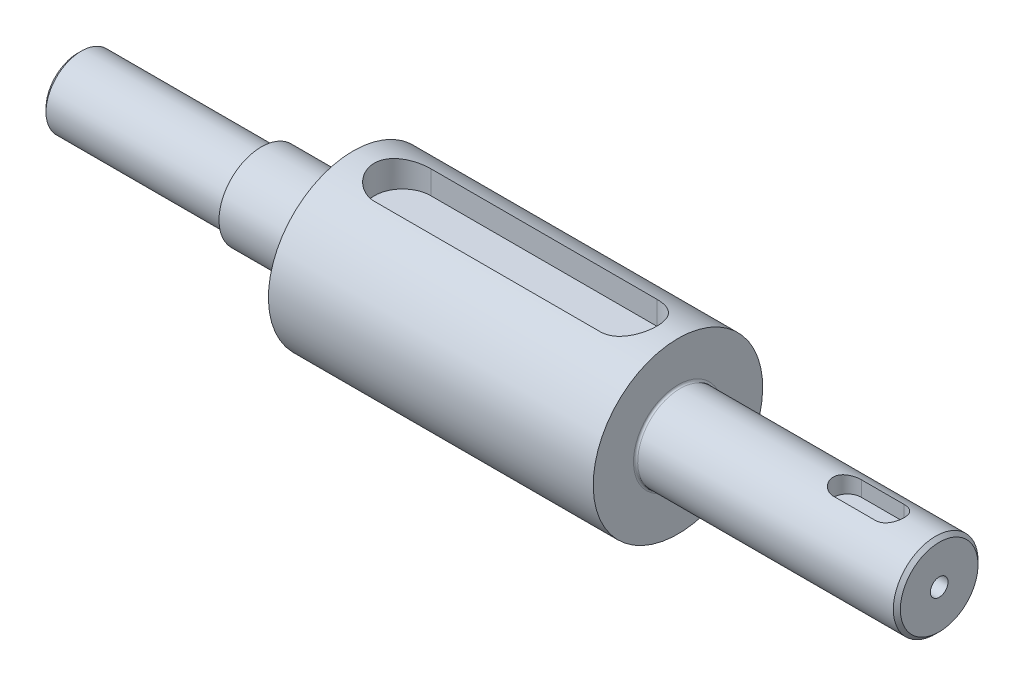
ISO-10303-21;
HEADER;
FILE_DESCRIPTION(('STEP AP214'),'2;1');
FILE_NAME('part.step','',(''),(''),'','','');
FILE_SCHEMA(('AUTOMOTIVE_DESIGN { 1 0 10303 214 1 1 1 1 }'));
ENDSEC;
DATA;
#1=APPLICATION_CONTEXT('core data for automotive mechanical design processes');
#2=APPLICATION_PROTOCOL_DEFINITION('international standard','automotive_design',2000,#1);
#3=PRODUCT_CONTEXT('',#1,'mechanical');
#4=PRODUCT('Part','Part','',(#3));
#5=PRODUCT_RELATED_PRODUCT_CATEGORY('part','',(#4));
#6=PRODUCT_DEFINITION_FORMATION('','',#4);
#7=PRODUCT_DEFINITION_CONTEXT('part definition',#1,'design');
#8=PRODUCT_DEFINITION('design','',#6,#7);
#9=PRODUCT_DEFINITION_SHAPE('','',#8);
#10=(LENGTH_UNIT() NAMED_UNIT(*) SI_UNIT(.MILLI.,.METRE.));
#11=(NAMED_UNIT(*) PLANE_ANGLE_UNIT() SI_UNIT($,.RADIAN.));
#12=(NAMED_UNIT(*) SI_UNIT($,.STERADIAN.) SOLID_ANGLE_UNIT());
#13=UNCERTAINTY_MEASURE_WITH_UNIT(LENGTH_MEASURE(1.E-05),#10,'distance_accuracy_value','');
#14=(GEOMETRIC_REPRESENTATION_CONTEXT(3) GLOBAL_UNCERTAINTY_ASSIGNED_CONTEXT((#13)) GLOBAL_UNIT_ASSIGNED_CONTEXT((#10,
#11,#12)) REPRESENTATION_CONTEXT('',''));
#15=CARTESIAN_POINT('',(0.,0.,0.));
#16=DIRECTION('',(0.,0.,1.));
#17=DIRECTION('',(1.,0.,0.));
#18=AXIS2_PLACEMENT_3D('',#15,#16,#17);
#19=CARTESIAN_POINT('',(60.,0.,0.));
#20=DIRECTION('',(1.,0.,0.));
#21=DIRECTION('',(0.,1.,0.));
#22=AXIS2_PLACEMENT_3D('',#19,#20,#21);
#23=CYLINDRICAL_SURFACE('',#22,6.00000000000001);
#24=CARTESIAN_POINT('',(23.3,0.,0.));
#25=DIRECTION('',(1.,0.,0.));
#26=DIRECTION('',(0.,1.,0.));
#27=AXIS2_PLACEMENT_3D('',#24,#25,#26);
#28=CIRCLE('',#27,6.00000000000001);
#29=CARTESIAN_POINT('',(23.3,6.,0.));
#30=VERTEX_POINT('',#29);
#31=EDGE_CURVE('E55',#30,#30,#28,.T.);
#32=ORIENTED_EDGE('',*,*,#31,.T.);
#33=EDGE_LOOP('',(#32));
#34=FACE_BOUND('',#33,.T.);
#35=CARTESIAN_POINT('',(59.5,0.,0.));
#36=DIRECTION('',(-1.,0.,0.));
#37=DIRECTION('',(0.,0.,1.));
#38=AXIS2_PLACEMENT_3D('',#35,#36,#37);
#39=CIRCLE('',#38,6.00000000000001);
#40=CARTESIAN_POINT('',(59.5,0.,6.00000000000001));
#41=VERTEX_POINT('',#40);
#42=EDGE_CURVE('E302',#41,#41,#39,.T.);
#43=ORIENTED_EDGE('',*,*,#42,.T.);
#44=EDGE_LOOP('',(#43));
#45=FACE_BOUND('',#44,.T.);
#46=CARTESIAN_POINT('',(53.,5.65685424949238,2.));
#47=CARTESIAN_POINT('',(53.0545809936022,5.65684884188678,2.0000014949184));
#48=CARTESIAN_POINT('',(53.1091341243786,5.6576451988649,1.99776424917478));
#49=CARTESIAN_POINT('',(53.2178171681098,5.66078654578442,1.9888512140728));
#50=CARTESIAN_POINT('',(53.2719471913194,5.66313111768244,1.98217662286705));
#51=CARTESIAN_POINT('',(53.4327842863903,5.67238184449302,1.95562135046157));
#52=CARTESIAN_POINT('',(53.538361692541,5.6815058499903,1.92920846605623));
#53=CARTESIAN_POINT('',(53.7432503848876,5.70456149397718,1.85991682366085));
#54=CARTESIAN_POINT('',(53.8425650937458,5.71849047905859,1.81704715197507));
#55=CARTESIAN_POINT('',(54.0326796680109,5.74957574438921,1.71614645792974));
#56=CARTESIAN_POINT('',(54.1234742581347,5.76673400456216,1.65810612564547));
#57=CARTESIAN_POINT('',(54.2974404626491,5.80308960804095,1.52610278704602));
#58=CARTESIAN_POINT('',(54.3802297609252,5.82233755536618,1.45164996064407));
#59=CARTESIAN_POINT('',(54.5324120355834,5.86027697385956,1.28997688598296));
#60=CARTESIAN_POINT('',(54.6018026265119,5.87896834543706,1.20275436910907));
#61=CARTESIAN_POINT('',(54.7269590376084,5.91427765988454,1.01520729191252));
#62=CARTESIAN_POINT('',(54.7823219688045,5.93082875123708,0.914600178716988));
#63=CARTESIAN_POINT('',(54.8751845033745,5.95939217209317,0.704858499931712));
#64=CARTESIAN_POINT('',(54.9126895636409,5.97140588786619,0.595726551186833));
#65=CARTESIAN_POINT('',(54.9674714521827,5.98918142285845,0.376058690956067));
#66=CARTESIAN_POINT('',(54.9854065451074,5.99514617977147,0.265703668920218));
#67=CARTESIAN_POINT('',(55.0026325970512,6.00087216807634,0.0433979389113407));
#68=CARTESIAN_POINT('',(55.0019279985395,6.00063487762605,-0.0685523824907898));
#69=CARTESIAN_POINT('',(54.9823114337867,5.99412077270532,-0.286207690558789));
#70=CARTESIAN_POINT('',(54.9641147240811,5.98808121982527,-0.391985405251077));
#71=CARTESIAN_POINT('',(54.9112136026517,5.97093921001647,-0.598888128753316));
#72=CARTESIAN_POINT('',(54.8765082755875,5.95983647235462,-0.700012879232932));
#73=CARTESIAN_POINT('',(54.7911572607987,5.93351336542608,-0.896305246061929));
#74=CARTESIAN_POINT('',(54.7403079097553,5.91824075676625,-0.99137701130799));
#75=CARTESIAN_POINT('',(54.6242800972186,5.88516775360088,-1.17184917819498));
#76=CARTESIAN_POINT('',(54.559097737907,5.86736667195186,-1.25724693942937));
#77=CARTESIAN_POINT('',(54.4126579000063,5.83012543885479,-1.42019467942243));
#78=CARTESIAN_POINT('',(54.3307889127806,5.81064757359828,-1.4971872232254));
#79=CARTESIAN_POINT('',(54.1551170205677,5.77294980945702,-1.63654404964077));
#80=CARTESIAN_POINT('',(54.0613102751935,5.75473031831506,-1.69890360636763));
#81=CARTESIAN_POINT('',(53.8626396432934,5.72140062752635,-1.80800665118557));
#82=CARTESIAN_POINT('',(53.7576329701341,5.70634029896469,-1.85450601901537));
#83=CARTESIAN_POINT('',(53.5407060448201,5.68162194124078,-1.92892046140223));
#84=CARTESIAN_POINT('',(53.4287970132557,5.67195538817985,-1.95686487211071));
#85=CARTESIAN_POINT('',(53.263162726504,5.6627308418944,-1.98331631256166));
#86=CARTESIAN_POINT('',(53.2107172202915,5.66053335389204,-1.98957012251023));
#87=CARTESIAN_POINT('',(53.1055238432004,5.65759407142798,-1.9979092321424));
#88=CARTESIAN_POINT('',(53.0527764509112,5.65685039859056,-1.99999991078996));
#89=CARTESIAN_POINT('',(53.,5.65685424949238,-2.));
#90=B_SPLINE_CURVE_WITH_KNOTS('',3,(#46,#47,#48,#49,#50,#51,#52,#53,#54,#55,#56,#57,#58,#59,#60,
#61,#62,#63,#64,#65,#66,#67,#68,#69,#70,#71,#72,#73,#74,#75,#76,#77,#78,#79,#80,#81,#82,#83,#84,
#85,#86,#87,#88,#89),.UNSPECIFIED.,.F.,.F.,(4,2,2,2,2,2,2,2,2,2,2,2,2,2,2,2,2,2,2,2,2,4),(0.,
0.163636969470867,0.327229772338926,0.653162396790749,0.978915321932481,1.30486862627062,
1.64233009925356,1.97985159727495,2.32618265866203,2.67240782242255,3.00658941454806,
3.34069136061285,3.66168836931471,3.98270317816496,4.30794037651936,4.63326613177538,
4.973881081161,5.31460588498485,5.6603605985608,6.00556734973679,6.16399790665502,
6.32222363058113),.UNSPECIFIED.);
#91=CARTESIAN_POINT('',(53.,5.65685424949238,2.));
#92=VERTEX_POINT('',#91);
#93=CARTESIAN_POINT('',(53.,5.65685424949238,-2.));
#94=VERTEX_POINT('',#93);
#95=EDGE_CURVE('E257',#92,#94,#90,.T.);
#96=ORIENTED_EDGE('',*,*,#95,.F.);
#97=DIRECTION('',(1.,0.,0.));
#98=VECTOR('',#97,1.);
#99=CARTESIAN_POINT('',(60.,5.65685424949238,2.));
#100=LINE('',#99,#98);
#101=CARTESIAN_POINT('',(47.,5.65685424949238,2.));
#102=VERTEX_POINT('',#101);
#103=EDGE_CURVE('E295',#102,#92,#100,.T.);
#104=ORIENTED_EDGE('',*,*,#103,.F.);
#105=CARTESIAN_POINT('',(47.,5.65685424949238,-2.));
#106=CARTESIAN_POINT('',(46.9454190063977,5.65684884188678,-2.00000149491839));
#107=CARTESIAN_POINT('',(46.8908658756213,5.6576451988649,-1.99776424917478));
#108=CARTESIAN_POINT('',(46.7821828318902,5.66078654578442,-1.9888512140728));
#109=CARTESIAN_POINT('',(46.7280528086806,5.66313111768244,-1.98217662286705));
#110=CARTESIAN_POINT('',(46.5672157136097,5.67238184449302,-1.95562135046157));
#111=CARTESIAN_POINT('',(46.461638307459,5.6815058499903,-1.92920846605622));
#112=CARTESIAN_POINT('',(46.2567496151124,5.70456149397718,-1.85991682366085));
#113=CARTESIAN_POINT('',(46.1574349062541,5.71849047905858,-1.81704715197506));
#114=CARTESIAN_POINT('',(45.9673203319891,5.74957574438921,-1.71614645792973));
#115=CARTESIAN_POINT('',(45.8765257418653,5.76673400456216,-1.65810612564547));
#116=CARTESIAN_POINT('',(45.7025595373509,5.80308960804095,-1.52610278704602));
#117=CARTESIAN_POINT('',(45.6197702390748,5.82233755536618,-1.45164996064407));
#118=CARTESIAN_POINT('',(45.4675879644166,5.86027697385956,-1.28997688598296));
#119=CARTESIAN_POINT('',(45.3981973734881,5.87896834543706,-1.20275436910907));
#120=CARTESIAN_POINT('',(45.2730409623916,5.91427765988454,-1.01520729191252));
#121=CARTESIAN_POINT('',(45.2176780311955,5.93082875123708,-0.914600178716987));
#122=CARTESIAN_POINT('',(45.1248154966255,5.95939217209317,-0.704858499931711));
#123=CARTESIAN_POINT('',(45.0873104363591,5.97140588786619,-0.595726551186832));
#124=CARTESIAN_POINT('',(45.0325285478172,5.98918142285845,-0.376058690956066));
#125=CARTESIAN_POINT('',(45.0145934548926,5.99514617977147,-0.265703668920217));
#126=CARTESIAN_POINT('',(44.9973674029488,6.00087216807634,-0.0433979389113397));
#127=CARTESIAN_POINT('',(44.9980720014605,6.00063487762605,0.0685523824907907));
#128=CARTESIAN_POINT('',(45.0176885662133,5.99412077270532,0.28620769055879));
#129=CARTESIAN_POINT('',(45.0358852759189,5.98808121982527,0.391985405251078));
#130=CARTESIAN_POINT('',(45.0887863973482,5.97093921001647,0.598888128753317));
#131=CARTESIAN_POINT('',(45.1234917244125,5.95983647235462,0.700012879232933));
#132=CARTESIAN_POINT('',(45.2088427392012,5.93351336542608,0.89630524606193));
#133=CARTESIAN_POINT('',(45.2596920902447,5.91824075676625,0.99137701130799));
#134=CARTESIAN_POINT('',(45.3757199027814,5.88516775360088,1.17184917819498));
#135=CARTESIAN_POINT('',(45.440902262093,5.86736667195186,1.25724693942937));
#136=CARTESIAN_POINT('',(45.5873420999937,5.83012543885479,1.42019467942243));
#137=CARTESIAN_POINT('',(45.6692110872194,5.81064757359828,1.4971872232254));
#138=CARTESIAN_POINT('',(45.8448829794323,5.77294980945702,1.63654404964077));
#139=CARTESIAN_POINT('',(45.9386897248065,5.75473031831506,1.69890360636763));
#140=CARTESIAN_POINT('',(46.1373603567066,5.72140062752635,1.80800665118557));
#141=CARTESIAN_POINT('',(46.2423670298659,5.70634029896469,1.85450601901537));
#142=CARTESIAN_POINT('',(46.4592939551799,5.68162194124078,1.92892046140224));
#143=CARTESIAN_POINT('',(46.5712029867443,5.67195538817985,1.95686487211072));
#144=CARTESIAN_POINT('',(46.736837273496,5.6627308418944,1.98331631256166));
#145=CARTESIAN_POINT('',(46.7892827797084,5.66053335389204,1.98957012251023));
#146=CARTESIAN_POINT('',(46.8944761567996,5.65759407142798,1.9979092321424));
#147=CARTESIAN_POINT('',(46.9472235490888,5.65685039859056,1.99999991078996));
#148=CARTESIAN_POINT('',(47.,5.65685424949238,2.));
#149=B_SPLINE_CURVE_WITH_KNOTS('',3,(#105,#106,#107,#108,#109,#110,#111,#112,#113,#114,#115,
#116,#117,#118,#119,#120,#121,#122,#123,#124,#125,#126,#127,#128,#129,#130,#131,#132,#133,#134,
#135,#136,#137,#138,#139,#140,#141,#142,#143,#144,#145,#146,#147,#148),.UNSPECIFIED.,.F.,.F.,(4,
2,2,2,2,2,2,2,2,2,2,2,2,2,2,2,2,2,2,2,2,4),(0.,0.163636969470867,0.327229772338926,
0.653162396790749,0.978915321932481,1.30486862627063,1.64233009925356,1.97985159727495,
2.32618265866203,2.67240782242255,3.00658941454806,3.34069136061285,3.66168836931471,
3.98270317816496,4.30794037651936,4.63326613177538,4.97388108116101,5.31460588498485,
5.66036059856081,6.00556734973679,6.16399790665502,6.32222363058113),.UNSPECIFIED.);
#150=CARTESIAN_POINT('',(47.,5.65685424949238,-2.));
#151=VERTEX_POINT('',#150);
#152=EDGE_CURVE('E288',#151,#102,#149,.T.);
#153=ORIENTED_EDGE('',*,*,#152,.F.);
#154=DIRECTION('',(1.,0.,0.));
#155=VECTOR('',#154,1.);
#156=CARTESIAN_POINT('',(60.,5.65685424949238,-2.));
#157=LINE('',#156,#155);
#158=EDGE_CURVE('E266',#94,#151,#157,.F.);
#159=ORIENTED_EDGE('',*,*,#158,.F.);
#160=EDGE_LOOP('',(#96,#104,#153,#159));
#161=FACE_BOUND('',#160,.T.);
#162=ADVANCED_FACE('F46',(#34,#45,#161),#23,.T.);
#163=CARTESIAN_POINT('',(60.,0.,0.));
#164=DIRECTION('',(1.,0.,0.));
#165=DIRECTION('',(0.,1.,0.));
#166=AXIS2_PLACEMENT_3D('',#163,#164,#165);
#167=CYLINDRICAL_SURFACE('',#166,12.);
#168=CARTESIAN_POINT('',(-23.,0.,0.));
#169=DIRECTION('',(1.,0.,0.));
#170=DIRECTION('',(0.,1.,0.));
#171=AXIS2_PLACEMENT_3D('',#168,#169,#170);
#172=CIRCLE('',#171,12.);
#173=CARTESIAN_POINT('',(-23.,12.,0.));
#174=VERTEX_POINT('',#173);
#175=EDGE_CURVE('E205',#174,#174,#172,.T.);
#176=ORIENTED_EDGE('',*,*,#175,.T.);
#177=EDGE_LOOP('',(#176));
#178=FACE_BOUND('',#177,.T.);
#179=CARTESIAN_POINT('',(23.,0.,0.));
#180=DIRECTION('',(1.,0.,0.));
#181=DIRECTION('',(0.,1.,0.));
#182=AXIS2_PLACEMENT_3D('',#179,#180,#181);
#183=CIRCLE('',#182,12.);
#184=CARTESIAN_POINT('',(23.,12.,0.));
#185=VERTEX_POINT('',#184);
#186=EDGE_CURVE('E209',#185,#185,#183,.T.);
#187=ORIENTED_EDGE('',*,*,#186,.F.);
#188=EDGE_LOOP('',(#187));
#189=FACE_BOUND('',#188,.T.);
#190=DIRECTION('',(1.,0.,0.));
#191=VECTOR('',#190,1.);
#192=CARTESIAN_POINT('',(60.,11.3137084989848,-4.00000000000002));
#193=LINE('',#192,#191);
#194=CARTESIAN_POINT('',(-16.,11.3137084989848,-4.));
#195=VERTEX_POINT('',#194);
#196=CARTESIAN_POINT('',(16.,11.3137084989848,-4.00000000000002));
#197=VERTEX_POINT('',#196);
#198=EDGE_CURVE('E253',#195,#197,#193,.T.);
#199=ORIENTED_EDGE('',*,*,#198,.T.);
#200=CARTESIAN_POINT('',(16.,11.3137084989848,-4.00000000000001));
#201=CARTESIAN_POINT('',(16.1091313245125,11.3136910923705,-4.00001438576651));
#202=CARTESIAN_POINT('',(16.2182529194806,11.3152871024731,-3.99553419554537));
#203=CARTESIAN_POINT('',(16.4356496613588,11.3215763859361,-3.97769673248753));
#204=CARTESIAN_POINT('',(16.5439250287809,11.3262688232103,-3.96434185595522));
#205=CARTESIAN_POINT('',(16.7585447813673,11.3386032840401,-3.92891935076474));
#206=CARTESIAN_POINT('',(16.8648939240815,11.3462365576019,-3.90687756421022));
#207=CARTESIAN_POINT('',(17.0752132297324,11.364201918496,-3.85430689648188));
#208=CARTESIAN_POINT('',(17.1791833065435,11.3745341033652,-3.82377770857635));
#209=CARTESIAN_POINT('',(17.4863385275441,11.4091190527027,-3.71986482089948));
#210=CARTESIAN_POINT('',(17.685086651956,11.4369799021453,-3.63410266896588));
#211=CARTESIAN_POINT('',(18.0654028983374,11.4991525453998,-3.43228454569821));
#212=CARTESIAN_POINT('',(18.246960377233,11.5334682968154,-3.31620997228937));
#213=CARTESIAN_POINT('',(18.5948686455691,11.6061789182336,-3.05220793355649));
#214=CARTESIAN_POINT('',(18.7604562284894,11.6446750308563,-2.90330055412141));
#215=CARTESIAN_POINT('',(19.0648273651136,11.7205540276094,-2.57995313902011));
#216=CARTESIAN_POINT('',(19.203606145885,11.7579367125094,-2.40550856651357));
#217=CARTESIAN_POINT('',(19.4539171590512,11.8285552975691,-2.03041476001126));
#218=CARTESIAN_POINT('',(19.5646436932612,11.8616574966305,-1.82920040495824));
#219=CARTESIAN_POINT('',(19.7503692510222,11.9187843500282,-1.40971695235373));
#220=CARTESIAN_POINT('',(19.8253791886194,11.9428117769099,-1.19145308844236));
#221=CARTESIAN_POINT('',(19.9349428451614,11.9783628445804,-0.752117395358874));
#222=CARTESIAN_POINT('',(19.9708130850918,11.9902923605184,-0.531407346429916));
#223=CARTESIAN_POINT('',(20.0052651992241,12.0017443351774,-0.0867958692352884));
#224=CARTESIAN_POINT('',(20.0038559583873,12.0012697502156,0.137104785886808));
#225=CARTESIAN_POINT('',(19.9646229047474,11.9882415502496,0.57241536103231));
#226=CARTESIAN_POINT('',(19.9282295986696,11.9761624577266,0.78397073966375));
#227=CARTESIAN_POINT('',(19.8224270547877,11.9418784019559,1.19777632834893));
#228=CARTESIAN_POINT('',(19.7530159862731,11.9196728772387,1.40002602175549));
#229=CARTESIAN_POINT('',(19.5823150939296,11.8670267992102,1.79261022537108));
#230=CARTESIAN_POINT('',(19.4806179693939,11.8364817702071,1.98275302130577));
#231=CARTESIAN_POINT('',(19.2485580439686,11.7703352504572,2.34369935797278));
#232=CARTESIAN_POINT('',(19.1181874454123,11.7347323851811,2.51449761883744));
#233=CARTESIAN_POINT('',(18.8253242078156,11.6602518814889,2.84038544309997));
#234=CARTESIAN_POINT('',(18.6616098897011,11.6212989752184,2.99435951335509));
#235=CARTESIAN_POINT('',(18.3102019666542,11.5458957896576,3.27310303719343));
#236=CARTESIAN_POINT('',(18.1225006450003,11.5094463215614,3.39786305574725));
#237=CARTESIAN_POINT('',(17.8252870496228,11.4595759659792,3.56109757745215));
#238=CARTESIAN_POINT('',(17.7227445952325,11.4436484943195,3.61182358389814));
#239=CARTESIAN_POINT('',(17.5134350190437,11.4140167075143,3.70440095621127));
#240=CARTESIAN_POINT('',(17.4066696779244,11.4003114674865,3.74625601636388));
#241=CARTESIAN_POINT('',(17.1897829134335,11.3755873303494,3.82067426911564));
#242=CARTESIAN_POINT('',(17.0796652868959,11.3645655126344,3.85324757051516));
#243=CARTESIAN_POINT('',(16.8568318455526,11.3455648512893,3.90883841588791));
#244=CARTESIAN_POINT('',(16.7441172420382,11.3375846182867,3.93186032329111));
#245=CARTESIAN_POINT('',(16.5263575534492,11.3254693235584,3.96661962949783));
#246=CARTESIAN_POINT('',(16.4214504804214,11.3210705251979,3.97913375141091));
#247=CARTESIAN_POINT('',(16.2110316673002,11.3151843303776,3.99582494949882));
#248=CARTESIAN_POINT('',(16.1055208843321,11.3136931771535,4.00001278362333));
#249=CARTESIAN_POINT('',(16.,11.3137084989848,3.99999999999999));
#250=B_SPLINE_CURVE_WITH_KNOTS('',3,(#200,#201,#202,#203,#204,#205,#206,#207,#208,#209,#210,
#211,#212,#213,#214,#215,#216,#217,#218,#219,#220,#221,#222,#223,#224,#225,#226,#227,#228,#229,
#230,#231,#232,#233,#234,#235,#236,#237,#238,#239,#240,#241,#242,#243,#244,#245,#246,#247,#248,
#249),.UNSPECIFIED.,.F.,.F.,(4,2,2,2,2,2,2,2,2,2,2,2,2,2,2,2,2,2,2,2,2,2,2,2,4),(0.,
0.327273938941731,0.654459544677845,0.980679087086514,1.30691042048862,1.95841627077208,
2.61032287944837,3.28524582541423,3.96028882145702,4.65295094423118,5.34540127175222,
6.01376445600324,6.68196834813282,7.32396236553653,7.96599198323704,8.61646637994584,
9.26711789045787,9.94834778922914,10.6297973968768,10.9759539762202,11.3219661149517,
11.6675999574416,12.0130757272824,12.3299368411189,12.6463882889711),.UNSPECIFIED.);
#251=CARTESIAN_POINT('',(16.,11.3137084989848,3.99999999999999));
#252=VERTEX_POINT('',#251);
#253=EDGE_CURVE('E70',#197,#252,#250,.T.);
#254=ORIENTED_EDGE('',*,*,#253,.T.);
#255=DIRECTION('',(1.,0.,0.));
#256=VECTOR('',#255,1.);
#257=CARTESIAN_POINT('',(60.,11.3137084989848,3.99999999999999));
#258=LINE('',#257,#256);
#259=CARTESIAN_POINT('',(-16.,11.3137084989848,4.));
#260=VERTEX_POINT('',#259);
#261=EDGE_CURVE('E221',#252,#260,#258,.F.);
#262=ORIENTED_EDGE('',*,*,#261,.T.);
#263=CARTESIAN_POINT('',(-16.,11.3137084989848,4.));
#264=CARTESIAN_POINT('',(-16.1091313245125,11.3136910923705,4.0000143857665));
#265=CARTESIAN_POINT('',(-16.2182529194806,11.3152871024731,3.99553419554536));
#266=CARTESIAN_POINT('',(-16.4356496613588,11.3215763859361,3.97769673248752));
#267=CARTESIAN_POINT('',(-16.5439250287809,11.3262688232103,3.96434185595522));
#268=CARTESIAN_POINT('',(-16.7585447813673,11.3386032840401,3.92891935076474));
#269=CARTESIAN_POINT('',(-16.8648939240815,11.3462365576019,3.90687756421021));
#270=CARTESIAN_POINT('',(-17.0752132297324,11.364201918496,3.85430689648188));
#271=CARTESIAN_POINT('',(-17.1791833065435,11.3745341033652,3.82377770857634));
#272=CARTESIAN_POINT('',(-17.4863385275441,11.4091190527027,3.71986482089947));
#273=CARTESIAN_POINT('',(-17.685086651956,11.4369799021453,3.63410266896587));
#274=CARTESIAN_POINT('',(-18.0654028983374,11.4991525453998,3.4322845456982));
#275=CARTESIAN_POINT('',(-18.246960377233,11.5334682968154,3.31620997228937));
#276=CARTESIAN_POINT('',(-18.5948686455691,11.6061789182336,3.05220793355649));
#277=CARTESIAN_POINT('',(-18.7604562284894,11.6446750308563,2.90330055412141));
#278=CARTESIAN_POINT('',(-19.0648273651136,11.7205540276094,2.57995313902011));
#279=CARTESIAN_POINT('',(-19.203606145885,11.7579367125094,2.40550856651356));
#280=CARTESIAN_POINT('',(-19.4539171590512,11.8285552975691,2.03041476001125));
#281=CARTESIAN_POINT('',(-19.5646436932612,11.8616574966305,1.82920040495823));
#282=CARTESIAN_POINT('',(-19.7503692510222,11.9187843500282,1.40971695235373));
#283=CARTESIAN_POINT('',(-19.8253791886194,11.9428117769099,1.19145308844236));
#284=CARTESIAN_POINT('',(-19.9349428451614,11.9783628445804,0.752117395358868));
#285=CARTESIAN_POINT('',(-19.9708130850918,11.9902923605184,0.53140734642991));
#286=CARTESIAN_POINT('',(-20.0052651992241,12.0017443351774,0.0867958692352824));
#287=CARTESIAN_POINT('',(-20.0038559583873,12.0012697502156,-0.137104785886814));
#288=CARTESIAN_POINT('',(-19.9646229047474,11.9882415502496,-0.572415361032317));
#289=CARTESIAN_POINT('',(-19.9282295986696,11.9761624577266,-0.783970739663756));
#290=CARTESIAN_POINT('',(-19.8224270547877,11.9418784019559,-1.19777632834894));
#291=CARTESIAN_POINT('',(-19.7530159862731,11.9196728772387,-1.4000260217555));
#292=CARTESIAN_POINT('',(-19.5823150939296,11.8670267992102,-1.79261022537109));
#293=CARTESIAN_POINT('',(-19.4806179693939,11.8364817702071,-1.98275302130578));
#294=CARTESIAN_POINT('',(-19.2485580439686,11.7703352504572,-2.34369935797278));
#295=CARTESIAN_POINT('',(-19.1181874454123,11.7347323851811,-2.51449761883744));
#296=CARTESIAN_POINT('',(-18.8253242078155,11.6602518814889,-2.84038544309998));
#297=CARTESIAN_POINT('',(-18.6616098897011,11.6212989752184,-2.99435951335509));
#298=CARTESIAN_POINT('',(-18.3102019666542,11.5458957896576,-3.27310303719343));
#299=CARTESIAN_POINT('',(-18.1225006450003,11.5094463215614,-3.39786305574725));
#300=CARTESIAN_POINT('',(-17.8252870496228,11.4595759659792,-3.56109757745215));
#301=CARTESIAN_POINT('',(-17.7227445952325,11.4436484943195,-3.61182358389815));
#302=CARTESIAN_POINT('',(-17.5134350190437,11.4140167075143,-3.70440095621127));
#303=CARTESIAN_POINT('',(-17.4066696779244,11.4003114674865,-3.74625601636388));
#304=CARTESIAN_POINT('',(-17.1897829134335,11.3755873303494,-3.82067426911565));
#305=CARTESIAN_POINT('',(-17.0796652868959,11.3645655126344,-3.85324757051516));
#306=CARTESIAN_POINT('',(-16.8568318455526,11.3455648512893,-3.90883841588792));
#307=CARTESIAN_POINT('',(-16.7441172420382,11.3375846182867,-3.93186032329112));
#308=CARTESIAN_POINT('',(-16.5263575534492,11.3254693235584,-3.96661962949784));
#309=CARTESIAN_POINT('',(-16.4214504804214,11.3210705251979,-3.97913375141091));
#310=CARTESIAN_POINT('',(-16.2110316673002,11.3151843303776,-3.99582494949883));
#311=CARTESIAN_POINT('',(-16.1055208843321,11.3136931771535,-4.00001278362333));
#312=CARTESIAN_POINT('',(-16.,11.3137084989848,-4.));
#313=B_SPLINE_CURVE_WITH_KNOTS('',3,(#263,#264,#265,#266,#267,#268,#269,#270,#271,#272,#273,
#274,#275,#276,#277,#278,#279,#280,#281,#282,#283,#284,#285,#286,#287,#288,#289,#290,#291,#292,
#293,#294,#295,#296,#297,#298,#299,#300,#301,#302,#303,#304,#305,#306,#307,#308,#309,#310,#311,
#312),.UNSPECIFIED.,.F.,.F.,(4,2,2,2,2,2,2,2,2,2,2,2,2,2,2,2,2,2,2,2,2,2,2,2,4),(0.,
0.327273938941731,0.654459544677845,0.980679087086521,1.30691042048862,1.95841627077208,
2.61032287944837,3.28524582541423,3.96028882145702,4.65295094423118,5.34540127175222,
6.01376445600324,6.68196834813282,7.32396236553653,7.96599198323704,8.61646637994583,
9.26711789045787,9.94834778922914,10.6297973968768,10.9759539762202,11.3219661149517,
11.6675999574416,12.0130757272824,12.3299368411189,12.6463882889711),.UNSPECIFIED.);
#314=EDGE_CURVE('E245',#260,#195,#313,.T.);
#315=ORIENTED_EDGE('',*,*,#314,.T.);
#316=EDGE_LOOP('',(#199,#254,#262,#315));
#317=FACE_BOUND('',#316,.T.);
#318=ADVANCED_FACE('F223',(#178,#189,#317),#167,.T.);
#319=CARTESIAN_POINT('',(23.,12.,0.));
#320=DIRECTION('',(1.,0.,0.));
#321=DIRECTION('',(0.,1.,0.));
#322=AXIS2_PLACEMENT_3D('',#319,#320,#321);
#323=PLANE('',#322);
#324=CARTESIAN_POINT('',(23.,0.,0.));
#325=DIRECTION('',(1.,0.,0.));
#326=DIRECTION('',(0.,1.,0.));
#327=AXIS2_PLACEMENT_3D('',#324,#325,#326);
#328=CIRCLE('',#327,6.30000000000001);
#329=CARTESIAN_POINT('',(23.,6.3,0.));
#330=VERTEX_POINT('',#329);
#331=EDGE_CURVE('E11',#330,#330,#328,.F.);
#332=ORIENTED_EDGE('',*,*,#331,.T.);
#333=EDGE_LOOP('',(#332));
#334=FACE_BOUND('',#333,.T.);
#335=ORIENTED_EDGE('',*,*,#186,.T.);
#336=EDGE_LOOP('',(#335));
#337=FACE_BOUND('',#336,.T.);
#338=ADVANCED_FACE('F350',(#334,#337),#323,.T.);
#339=CARTESIAN_POINT('',(-23.,6.,0.));
#340=DIRECTION('',(-1.,0.,0.));
#341=DIRECTION('',(0.,-1.,0.));
#342=AXIS2_PLACEMENT_3D('',#339,#340,#341);
#343=PLANE('',#342);
#344=CARTESIAN_POINT('',(-23.,0.,0.));
#345=DIRECTION('',(-1.,0.,0.));
#346=DIRECTION('',(0.,-1.,0.));
#347=AXIS2_PLACEMENT_3D('',#344,#345,#346);
#348=CIRCLE('',#347,6.30000000000001);
#349=CARTESIAN_POINT('',(-23.,-6.30000000000002,0.));
#350=VERTEX_POINT('',#349);
#351=EDGE_CURVE('E322',#350,#350,#348,.F.);
#352=ORIENTED_EDGE('',*,*,#351,.T.);
#353=EDGE_LOOP('',(#352));
#354=FACE_BOUND('',#353,.T.);
#355=ORIENTED_EDGE('',*,*,#175,.F.);
#356=EDGE_LOOP('',(#355));
#357=FACE_BOUND('',#356,.T.);
#358=ADVANCED_FACE('F355',(#354,#357),#343,.T.);
#359=CARTESIAN_POINT('',(60.,0.,0.));
#360=DIRECTION('',(1.,0.,0.));
#361=DIRECTION('',(0.,1.,0.));
#362=AXIS2_PLACEMENT_3D('',#359,#360,#361);
#363=CYLINDRICAL_SURFACE('',#362,6.00000000000001);
#364=CARTESIAN_POINT('',(-23.3,0.,0.));
#365=DIRECTION('',(-1.,0.,0.));
#366=DIRECTION('',(0.,-1.,0.));
#367=AXIS2_PLACEMENT_3D('',#364,#365,#366);
#368=CIRCLE('',#367,6.00000000000001);
#369=CARTESIAN_POINT('',(-23.3,-6.00000000000002,0.));
#370=VERTEX_POINT('',#369);
#371=EDGE_CURVE('E326',#370,#370,#368,.T.);
#372=ORIENTED_EDGE('',*,*,#371,.T.);
#373=EDGE_LOOP('',(#372));
#374=FACE_BOUND('',#373,.T.);
#375=CARTESIAN_POINT('',(-35.9999999999976,0.,0.));
#376=DIRECTION('',(1.,0.,0.));
#377=DIRECTION('',(0.,1.,0.));
#378=AXIS2_PLACEMENT_3D('',#375,#376,#377);
#379=CIRCLE('',#378,6.00000000000001);
#380=CARTESIAN_POINT('',(-35.9999999999976,6.,0.));
#381=VERTEX_POINT('',#380);
#382=EDGE_CURVE('E201',#381,#381,#379,.T.);
#383=ORIENTED_EDGE('',*,*,#382,.T.);
#384=EDGE_LOOP('',(#383));
#385=FACE_BOUND('',#384,.T.);
#386=ADVANCED_FACE('F438',(#374,#385),#363,.T.);
#387=CARTESIAN_POINT('',(-35.9999999999976,4.99999999999999,0.));
#388=DIRECTION('',(-1.,0.,0.));
#389=DIRECTION('',(0.,-1.,0.));
#390=AXIS2_PLACEMENT_3D('',#387,#388,#389);
#391=PLANE('',#390);
#392=CARTESIAN_POINT('',(-35.9999999999976,0.,0.));
#393=DIRECTION('',(-1.,0.,0.));
#394=DIRECTION('',(0.,-1.,0.));
#395=AXIS2_PLACEMENT_3D('',#392,#393,#394);
#396=CIRCLE('',#395,5.3);
#397=CARTESIAN_POINT('',(-35.9999999999976,-5.30000000000001,0.));
#398=VERTEX_POINT('',#397);
#399=EDGE_CURVE('E314',#398,#398,#396,.F.);
#400=ORIENTED_EDGE('',*,*,#399,.T.);
#401=EDGE_LOOP('',(#400));
#402=FACE_BOUND('',#401,.T.);
#403=ORIENTED_EDGE('',*,*,#382,.F.);
#404=EDGE_LOOP('',(#403));
#405=FACE_BOUND('',#404,.T.);
#406=ADVANCED_FACE('F411',(#402,#405),#391,.T.);
#407=CARTESIAN_POINT('',(60.,0.,0.));
#408=DIRECTION('',(1.,0.,0.));
#409=DIRECTION('',(0.,1.,0.));
#410=AXIS2_PLACEMENT_3D('',#407,#408,#409);
#411=CYLINDRICAL_SURFACE('',#410,5.);
#412=CARTESIAN_POINT('',(-36.2999999999976,0.,0.));
#413=DIRECTION('',(-1.,0.,0.));
#414=DIRECTION('',(0.,-1.,0.));
#415=AXIS2_PLACEMENT_3D('',#412,#413,#414);
#416=CIRCLE('',#415,5.);
#417=CARTESIAN_POINT('',(-36.2999999999976,-5.00000000000001,0.));
#418=VERTEX_POINT('',#417);
#419=EDGE_CURVE('E318',#418,#418,#416,.T.);
#420=ORIENTED_EDGE('',*,*,#419,.T.);
#421=EDGE_LOOP('',(#420));
#422=FACE_BOUND('',#421,.T.);
#423=CARTESIAN_POINT('',(-61.5,0.,0.));
#424=DIRECTION('',(-1.,0.,0.));
#425=DIRECTION('',(0.,0.,1.));
#426=AXIS2_PLACEMENT_3D('',#423,#424,#425);
#427=CIRCLE('',#426,5.);
#428=CARTESIAN_POINT('',(-61.5,0.,5.));
#429=VERTEX_POINT('',#428);
#430=EDGE_CURVE('E306',#429,#429,#427,.F.);
#431=ORIENTED_EDGE('',*,*,#430,.T.);
#432=EDGE_LOOP('',(#431));
#433=FACE_BOUND('',#432,.T.);
#434=ADVANCED_FACE('F404',(#422,#433),#411,.T.);
#435=CARTESIAN_POINT('',(-62.,4.99999999999999,0.));
#436=DIRECTION('',(-1.,0.,0.));
#437=DIRECTION('',(0.,-1.,0.));
#438=AXIS2_PLACEMENT_3D('',#435,#436,#437);
#439=PLANE('',#438);
#440=CARTESIAN_POINT('',(-62.,0.,0.));
#441=DIRECTION('',(-1.,0.,0.));
#442=DIRECTION('',(0.,-1.,0.));
#443=AXIS2_PLACEMENT_3D('',#440,#441,#442);
#444=CIRCLE('',#443,4.5);
#445=CARTESIAN_POINT('',(-62.,-4.50000000000002,0.));
#446=VERTEX_POINT('',#445);
#447=EDGE_CURVE('E310',#446,#446,#444,.T.);
#448=ORIENTED_EDGE('',*,*,#447,.T.);
#449=EDGE_LOOP('',(#448));
#450=FACE_BOUND('',#449,.T.);
#451=CARTESIAN_POINT('',(-62.,0.,0.));
#452=DIRECTION('',(-1.,0.,0.));
#453=DIRECTION('',(0.,0.,1.));
#454=AXIS2_PLACEMENT_3D('',#451,#452,#453);
#455=CIRCLE('',#454,1.25);
#456=CARTESIAN_POINT('',(-62.,0.,1.25));
#457=VERTEX_POINT('',#456);
#458=EDGE_CURVE('E130',#457,#457,#455,.T.);
#459=ORIENTED_EDGE('',*,*,#458,.F.);
#460=EDGE_LOOP('',(#459));
#461=FACE_BOUND('',#460,.T.);
#462=ADVANCED_FACE('F242',(#450,#461),#439,.T.);
#463=CARTESIAN_POINT('',(-16.,12.,0.));
#464=DIRECTION('',(0.,-1.,0.));
#465=DIRECTION('',(0.,0.,-1.));
#466=AXIS2_PLACEMENT_3D('',#463,#464,#465);
#467=CYLINDRICAL_SURFACE('',#466,4.);
#468=DIRECTION('',(0.,-1.,0.));
#469=VECTOR('',#468,1.);
#470=CARTESIAN_POINT('',(-16.,12.,4.));
#471=LINE('',#470,#469);
#472=CARTESIAN_POINT('',(-16.,8.,4.));
#473=VERTEX_POINT('',#472);
#474=EDGE_CURVE('E198',#260,#473,#471,.T.);
#475=ORIENTED_EDGE('',*,*,#474,.T.);
#476=CARTESIAN_POINT('',(-16.,8.,0.));
#477=DIRECTION('',(0.,1.,0.));
#478=DIRECTION('',(0.,0.,1.));
#479=AXIS2_PLACEMENT_3D('',#476,#477,#478);
#480=CIRCLE('',#479,4.);
#481=CARTESIAN_POINT('',(-16.,8.,-4.));
#482=VERTEX_POINT('',#481);
#483=EDGE_CURVE('E163',#482,#473,#480,.T.);
#484=ORIENTED_EDGE('',*,*,#483,.F.);
#485=DIRECTION('',(0.,-1.,0.));
#486=VECTOR('',#485,1.);
#487=CARTESIAN_POINT('',(-16.,12.,-4.));
#488=LINE('',#487,#486);
#489=EDGE_CURVE('E189',#195,#482,#488,.T.);
#490=ORIENTED_EDGE('',*,*,#489,.F.);
#491=ORIENTED_EDGE('',*,*,#314,.F.);
#492=EDGE_LOOP('',(#475,#484,#490,#491));
#493=FACE_BOUND('',#492,.T.);
#494=ADVANCED_FACE('F237',(#493),#467,.F.);
#495=CARTESIAN_POINT('',(-16.,12.,4.));
#496=DIRECTION('',(0.,0.,-1.));
#497=DIRECTION('',(-1.,0.,0.));
#498=AXIS2_PLACEMENT_3D('',#495,#496,#497);
#499=PLANE('',#498);
#500=DIRECTION('',(0.,-1.,0.));
#501=VECTOR('',#500,1.);
#502=CARTESIAN_POINT('',(16.,12.,3.99999999999999));
#503=LINE('',#502,#501);
#504=CARTESIAN_POINT('',(16.,8.,3.99999999999999));
#505=VERTEX_POINT('',#504);
#506=EDGE_CURVE('E195',#252,#505,#503,.T.);
#507=ORIENTED_EDGE('',*,*,#506,.T.);
#508=DIRECTION('',(1.,0.,0.));
#509=VECTOR('',#508,1.);
#510=CARTESIAN_POINT('',(-16.,8.,4.));
#511=LINE('',#510,#509);
#512=EDGE_CURVE('E177',#473,#505,#511,.T.);
#513=ORIENTED_EDGE('',*,*,#512,.F.);
#514=ORIENTED_EDGE('',*,*,#474,.F.);
#515=ORIENTED_EDGE('',*,*,#261,.F.);
#516=EDGE_LOOP('',(#507,#513,#514,#515));
#517=FACE_BOUND('',#516,.T.);
#518=ADVANCED_FACE('F233',(#517),#499,.T.);
#519=CARTESIAN_POINT('',(16.,12.,0.));
#520=DIRECTION('',(0.,-1.,0.));
#521=DIRECTION('',(0.,0.,-1.));
#522=AXIS2_PLACEMENT_3D('',#519,#520,#521);
#523=CYLINDRICAL_SURFACE('',#522,4.);
#524=DIRECTION('',(0.,-1.,0.));
#525=VECTOR('',#524,1.);
#526=CARTESIAN_POINT('',(16.,12.,-4.00000000000001));
#527=LINE('',#526,#525);
#528=CARTESIAN_POINT('',(16.,8.,-4.00000000000001));
#529=VERTEX_POINT('',#528);
#530=EDGE_CURVE('E192',#197,#529,#527,.T.);
#531=ORIENTED_EDGE('',*,*,#530,.T.);
#532=CARTESIAN_POINT('',(16.,8.,0.));
#533=DIRECTION('',(0.,1.,0.));
#534=DIRECTION('',(0.,0.,1.));
#535=AXIS2_PLACEMENT_3D('',#532,#533,#534);
#536=CIRCLE('',#535,4.);
#537=EDGE_CURVE('E181',#505,#529,#536,.T.);
#538=ORIENTED_EDGE('',*,*,#537,.F.);
#539=ORIENTED_EDGE('',*,*,#506,.F.);
#540=ORIENTED_EDGE('',*,*,#253,.F.);
#541=EDGE_LOOP('',(#531,#538,#539,#540));
#542=FACE_BOUND('',#541,.T.);
#543=ADVANCED_FACE('F227',(#542),#523,.F.);
#544=CARTESIAN_POINT('',(-16.,12.,-4.));
#545=DIRECTION('',(0.,0.,1.));
#546=DIRECTION('',(1.,0.,0.));
#547=AXIS2_PLACEMENT_3D('',#544,#545,#546);
#548=PLANE('',#547);
#549=ORIENTED_EDGE('',*,*,#489,.T.);
#550=DIRECTION('',(-1.,0.,0.));
#551=VECTOR('',#550,1.);
#552=CARTESIAN_POINT('',(-16.,8.,-4.));
#553=LINE('',#552,#551);
#554=EDGE_CURVE('E185',#529,#482,#553,.T.);
#555=ORIENTED_EDGE('',*,*,#554,.F.);
#556=ORIENTED_EDGE('',*,*,#530,.F.);
#557=ORIENTED_EDGE('',*,*,#198,.F.);
#558=EDGE_LOOP('',(#549,#555,#556,#557));
#559=FACE_BOUND('',#558,.T.);
#560=ADVANCED_FACE('F232',(#559),#548,.T.);
#561=CARTESIAN_POINT('',(-16.,8.,0.));
#562=DIRECTION('',(0.,1.,0.));
#563=DIRECTION('',(0.,0.,1.));
#564=AXIS2_PLACEMENT_3D('',#561,#562,#563);
#565=PLANE('',#564);
#566=ORIENTED_EDGE('',*,*,#483,.T.);
#567=ORIENTED_EDGE('',*,*,#512,.T.);
#568=ORIENTED_EDGE('',*,*,#537,.T.);
#569=ORIENTED_EDGE('',*,*,#554,.T.);
#570=EDGE_LOOP('',(#566,#567,#568,#569));
#571=FACE_BOUND('',#570,.T.);
#572=ADVANCED_FACE('F369',(#571),#565,.T.);
#573=CARTESIAN_POINT('',(60.,0.,0.));
#574=DIRECTION('',(-1.,0.,0.));
#575=DIRECTION('',(0.,0.,1.));
#576=AXIS2_PLACEMENT_3D('',#573,#574,#575);
#577=PLANE('',#576);
#578=CARTESIAN_POINT('',(60.,0.,0.));
#579=DIRECTION('',(-1.,0.,0.));
#580=DIRECTION('',(0.,0.,1.));
#581=AXIS2_PLACEMENT_3D('',#578,#579,#580);
#582=CIRCLE('',#581,5.49999999999999);
#583=CARTESIAN_POINT('',(60.,0.,5.49999999999999));
#584=VERTEX_POINT('',#583);
#585=EDGE_CURVE('E298',#584,#584,#582,.F.);
#586=ORIENTED_EDGE('',*,*,#585,.T.);
#587=EDGE_LOOP('',(#586));
#588=FACE_BOUND('',#587,.T.);
#589=CARTESIAN_POINT('',(60.,0.,0.));
#590=DIRECTION('',(1.,0.,0.));
#591=DIRECTION('',(0.,0.,-1.));
#592=AXIS2_PLACEMENT_3D('',#589,#590,#591);
#593=CIRCLE('',#592,1.25);
#594=CARTESIAN_POINT('',(60.,0.,-1.25));
#595=VERTEX_POINT('',#594);
#596=EDGE_CURVE('E129',#595,#595,#593,.T.);
#597=ORIENTED_EDGE('',*,*,#596,.F.);
#598=EDGE_LOOP('',(#597));
#599=FACE_BOUND('',#598,.T.);
#600=ADVANCED_FACE('F286',(#588,#599),#577,.F.);
#601=CARTESIAN_POINT('',(47.,3.5,0.));
#602=DIRECTION('',(0.,1.,0.));
#603=DIRECTION('',(0.,0.,1.));
#604=AXIS2_PLACEMENT_3D('',#601,#602,#603);
#605=CYLINDRICAL_SURFACE('',#604,2.);
#606=DIRECTION('',(0.,1.,0.));
#607=VECTOR('',#606,1.);
#608=CARTESIAN_POINT('',(47.,3.5,-2.));
#609=LINE('',#608,#607);
#610=CARTESIAN_POINT('',(47.,3.5,-2.));
#611=VERTEX_POINT('',#610);
#612=EDGE_CURVE('E159',#611,#151,#609,.T.);
#613=ORIENTED_EDGE('',*,*,#612,.T.);
#614=ORIENTED_EDGE('',*,*,#152,.T.);
#615=DIRECTION('',(0.,1.,0.));
#616=VECTOR('',#615,1.);
#617=CARTESIAN_POINT('',(47.,3.5,2.));
#618=LINE('',#617,#616);
#619=CARTESIAN_POINT('',(47.,3.5,2.));
#620=VERTEX_POINT('',#619);
#621=EDGE_CURVE('E62',#620,#102,#618,.T.);
#622=ORIENTED_EDGE('',*,*,#621,.F.);
#623=CARTESIAN_POINT('',(47.,3.5,0.));
#624=DIRECTION('',(0.,1.,0.));
#625=DIRECTION('',(0.,0.,1.));
#626=AXIS2_PLACEMENT_3D('',#623,#624,#625);
#627=CIRCLE('',#626,2.);
#628=EDGE_CURVE('E143',#611,#620,#627,.T.);
#629=ORIENTED_EDGE('',*,*,#628,.F.);
#630=EDGE_LOOP('',(#613,#614,#622,#629));
#631=FACE_BOUND('',#630,.T.);
#632=ADVANCED_FACE('F282',(#631),#605,.F.);
#633=CARTESIAN_POINT('',(47.,3.5,-2.));
#634=DIRECTION('',(0.,0.,-1.));
#635=DIRECTION('',(-1.,0.,0.));
#636=AXIS2_PLACEMENT_3D('',#633,#634,#635);
#637=PLANE('',#636);
#638=ORIENTED_EDGE('',*,*,#158,.T.);
#639=ORIENTED_EDGE('',*,*,#612,.F.);
#640=DIRECTION('',(-1.,0.,0.));
#641=VECTOR('',#640,1.);
#642=CARTESIAN_POINT('',(47.,3.5,-2.));
#643=LINE('',#642,#641);
#644=CARTESIAN_POINT('',(53.,3.5,-2.));
#645=VERTEX_POINT('',#644);
#646=EDGE_CURVE('E155',#645,#611,#643,.T.);
#647=ORIENTED_EDGE('',*,*,#646,.F.);
#648=DIRECTION('',(0.,1.,0.));
#649=VECTOR('',#648,1.);
#650=CARTESIAN_POINT('',(53.,3.5,-2.));
#651=LINE('',#650,#649);
#652=EDGE_CURVE('E164',#645,#94,#651,.T.);
#653=ORIENTED_EDGE('',*,*,#652,.T.);
#654=EDGE_LOOP('',(#638,#639,#647,#653));
#655=FACE_BOUND('',#654,.T.);
#656=ADVANCED_FACE('F276',(#655),#637,.F.);
#657=CARTESIAN_POINT('',(53.,3.5,0.));
#658=DIRECTION('',(0.,1.,0.));
#659=DIRECTION('',(0.,0.,1.));
#660=AXIS2_PLACEMENT_3D('',#657,#658,#659);
#661=CYLINDRICAL_SURFACE('',#660,2.);
#662=DIRECTION('',(0.,1.,0.));
#663=VECTOR('',#662,1.);
#664=CARTESIAN_POINT('',(53.,3.5,2.));
#665=LINE('',#664,#663);
#666=CARTESIAN_POINT('',(53.,3.5,2.));
#667=VERTEX_POINT('',#666);
#668=EDGE_CURVE('E168',#667,#92,#665,.T.);
#669=ORIENTED_EDGE('',*,*,#668,.T.);
#670=ORIENTED_EDGE('',*,*,#95,.T.);
#671=ORIENTED_EDGE('',*,*,#652,.F.);
#672=CARTESIAN_POINT('',(53.,3.5,0.));
#673=DIRECTION('',(0.,1.,0.));
#674=DIRECTION('',(0.,0.,1.));
#675=AXIS2_PLACEMENT_3D('',#672,#673,#674);
#676=CIRCLE('',#675,2.);
#677=EDGE_CURVE('E151',#667,#645,#676,.T.);
#678=ORIENTED_EDGE('',*,*,#677,.F.);
#679=EDGE_LOOP('',(#669,#670,#671,#678));
#680=FACE_BOUND('',#679,.T.);
#681=ADVANCED_FACE('F270',(#680),#661,.F.);
#682=CARTESIAN_POINT('',(47.,3.5,2.));
#683=DIRECTION('',(0.,0.,1.));
#684=DIRECTION('',(1.,0.,0.));
#685=AXIS2_PLACEMENT_3D('',#682,#683,#684);
#686=PLANE('',#685);
#687=ORIENTED_EDGE('',*,*,#103,.T.);
#688=ORIENTED_EDGE('',*,*,#668,.F.);
#689=DIRECTION('',(1.,0.,0.));
#690=VECTOR('',#689,1.);
#691=CARTESIAN_POINT('',(47.,3.5,2.));
#692=LINE('',#691,#690);
#693=EDGE_CURVE('E147',#620,#667,#692,.T.);
#694=ORIENTED_EDGE('',*,*,#693,.F.);
#695=ORIENTED_EDGE('',*,*,#621,.T.);
#696=EDGE_LOOP('',(#687,#688,#694,#695));
#697=FACE_BOUND('',#696,.T.);
#698=ADVANCED_FACE('F275',(#697),#686,.F.);
#699=CARTESIAN_POINT('',(47.,3.5,0.));
#700=DIRECTION('',(0.,1.,0.));
#701=DIRECTION('',(0.,0.,1.));
#702=AXIS2_PLACEMENT_3D('',#699,#700,#701);
#703=PLANE('',#702);
#704=ORIENTED_EDGE('',*,*,#628,.T.);
#705=ORIENTED_EDGE('',*,*,#693,.T.);
#706=ORIENTED_EDGE('',*,*,#677,.T.);
#707=ORIENTED_EDGE('',*,*,#646,.T.);
#708=EDGE_LOOP('',(#704,#705,#706,#707));
#709=FACE_BOUND('',#708,.T.);
#710=ADVANCED_FACE('F281',(#709),#703,.T.);
#711=CARTESIAN_POINT('',(53.2510757737844,0.,0.));
#712=DIRECTION('',(1.,0.,0.));
#713=DIRECTION('',(0.,0.,-1.));
#714=AXIS2_PLACEMENT_3D('',#711,#712,#713);
#715=CONICAL_SURFACE('',#714,1.25,1.02974425867665);
#716=CARTESIAN_POINT('',(52.5,0.,0.));
#717=VERTEX_POINT('',#716);
#718=VERTEX_LOOP('',#717);
#719=FACE_BOUND('',#718,.T.);
#720=CARTESIAN_POINT('',(53.2510757737844,0.,0.));
#721=DIRECTION('',(1.,0.,0.));
#722=DIRECTION('',(0.,0.,-1.));
#723=AXIS2_PLACEMENT_3D('',#720,#721,#722);
#724=CIRCLE('',#723,1.25);
#725=CARTESIAN_POINT('',(53.2510757737844,0.,-1.25));
#726=VERTEX_POINT('',#725);
#727=EDGE_CURVE('E135',#726,#726,#724,.T.);
#728=ORIENTED_EDGE('',*,*,#727,.T.);
#729=EDGE_LOOP('',(#728));
#730=FACE_BOUND('',#729,.T.);
#731=ADVANCED_FACE('F383',(#719,#730),#715,.F.);
#732=CARTESIAN_POINT('',(60.,0.,0.));
#733=DIRECTION('',(1.,0.,0.));
#734=DIRECTION('',(0.,0.,-1.));
#735=AXIS2_PLACEMENT_3D('',#732,#733,#734);
#736=CYLINDRICAL_SURFACE('',#735,1.25);
#737=ORIENTED_EDGE('',*,*,#727,.F.);
#738=EDGE_LOOP('',(#737));
#739=FACE_BOUND('',#738,.T.);
#740=ORIENTED_EDGE('',*,*,#596,.T.);
#741=EDGE_LOOP('',(#740));
#742=FACE_BOUND('',#741,.T.);
#743=ADVANCED_FACE('F122',(#739,#742),#736,.F.);
#744=CARTESIAN_POINT('',(-55.2510757737845,0.,0.));
#745=DIRECTION('',(-1.,0.,0.));
#746=DIRECTION('',(0.,0.,1.));
#747=AXIS2_PLACEMENT_3D('',#744,#745,#746);
#748=CONICAL_SURFACE('',#747,1.25,1.02974425867665);
#749=CARTESIAN_POINT('',(-54.5,0.,0.));
#750=VERTEX_POINT('',#749);
#751=VERTEX_LOOP('',#750);
#752=FACE_BOUND('',#751,.T.);
#753=CARTESIAN_POINT('',(-55.2510757737845,0.,0.));
#754=DIRECTION('',(-1.,0.,0.));
#755=DIRECTION('',(0.,0.,1.));
#756=AXIS2_PLACEMENT_3D('',#753,#754,#755);
#757=CIRCLE('',#756,1.25);
#758=CARTESIAN_POINT('',(-55.2510757737845,0.,1.25));
#759=VERTEX_POINT('',#758);
#760=EDGE_CURVE('E126',#759,#759,#757,.T.);
#761=ORIENTED_EDGE('',*,*,#760,.T.);
#762=EDGE_LOOP('',(#761));
#763=FACE_BOUND('',#762,.T.);
#764=ADVANCED_FACE('F118',(#752,#763),#748,.F.);
#765=CARTESIAN_POINT('',(-62.,0.,0.));
#766=DIRECTION('',(-1.,0.,0.));
#767=DIRECTION('',(0.,0.,1.));
#768=AXIS2_PLACEMENT_3D('',#765,#766,#767);
#769=CYLINDRICAL_SURFACE('',#768,1.25);
#770=ORIENTED_EDGE('',*,*,#760,.F.);
#771=EDGE_LOOP('',(#770));
#772=FACE_BOUND('',#771,.T.);
#773=ORIENTED_EDGE('',*,*,#458,.T.);
#774=EDGE_LOOP('',(#773));
#775=FACE_BOUND('',#774,.T.);
#776=ADVANCED_FACE('F121',(#772,#775),#769,.F.);
#777=CARTESIAN_POINT('',(60.,0.,0.));
#778=DIRECTION('',(-1.,0.,0.));
#779=DIRECTION('',(0.,0.,1.));
#780=AXIS2_PLACEMENT_3D('',#777,#778,#779);
#781=CONICAL_SURFACE('',#780,5.49999999999999,0.785398163397447);
#782=ORIENTED_EDGE('',*,*,#42,.F.);
#783=EDGE_LOOP('',(#782));
#784=FACE_BOUND('',#783,.T.);
#785=ORIENTED_EDGE('',*,*,#585,.F.);
#786=EDGE_LOOP('',(#785));
#787=FACE_BOUND('',#786,.T.);
#788=ADVANCED_FACE('F394',(#784,#787),#781,.T.);
#789=CARTESIAN_POINT('',(-61.5,0.,0.));
#790=DIRECTION('',(1.,0.,0.));
#791=DIRECTION('',(0.,0.,-1.));
#792=AXIS2_PLACEMENT_3D('',#789,#790,#791);
#793=CONICAL_SURFACE('',#792,5.,0.785398163397456);
#794=ORIENTED_EDGE('',*,*,#447,.F.);
#795=EDGE_LOOP('',(#794));
#796=FACE_BOUND('',#795,.T.);
#797=ORIENTED_EDGE('',*,*,#430,.F.);
#798=EDGE_LOOP('',(#797));
#799=FACE_BOUND('',#798,.T.);
#800=ADVANCED_FACE('F398',(#796,#799),#793,.T.);
#801=CARTESIAN_POINT('',(-36.2999999999976,0.,0.));
#802=DIRECTION('',(-1.,0.,0.));
#803=DIRECTION('',(0.,-1.,0.));
#804=AXIS2_PLACEMENT_3D('',#801,#802,#803);
#805=TOROIDAL_SURFACE('',#804,5.3,0.3);
#806=ORIENTED_EDGE('',*,*,#419,.F.);
#807=EDGE_LOOP('',(#806));
#808=FACE_BOUND('',#807,.T.);
#809=ORIENTED_EDGE('',*,*,#399,.F.);
#810=EDGE_LOOP('',(#809));
#811=FACE_BOUND('',#810,.T.);
#812=ADVANCED_FACE('F341',(#808,#811),#805,.F.);
#813=CARTESIAN_POINT('',(-23.3,0.,0.));
#814=DIRECTION('',(-1.,0.,0.));
#815=DIRECTION('',(0.,-1.,0.));
#816=AXIS2_PLACEMENT_3D('',#813,#814,#815);
#817=TOROIDAL_SURFACE('',#816,6.30000000000001,0.3);
#818=ORIENTED_EDGE('',*,*,#371,.F.);
#819=EDGE_LOOP('',(#818));
#820=FACE_BOUND('',#819,.T.);
#821=ORIENTED_EDGE('',*,*,#351,.F.);
#822=EDGE_LOOP('',(#821));
#823=FACE_BOUND('',#822,.T.);
#824=ADVANCED_FACE('F336',(#820,#823),#817,.F.);
#825=CARTESIAN_POINT('',(23.3,0.,0.));
#826=DIRECTION('',(1.,0.,0.));
#827=DIRECTION('',(0.,1.,0.));
#828=AXIS2_PLACEMENT_3D('',#825,#826,#827);
#829=TOROIDAL_SURFACE('',#828,6.30000000000001,0.3);
#830=ORIENTED_EDGE('',*,*,#331,.F.);
#831=EDGE_LOOP('',(#830));
#832=FACE_BOUND('',#831,.T.);
#833=ORIENTED_EDGE('',*,*,#31,.F.);
#834=EDGE_LOOP('',(#833));
#835=FACE_BOUND('',#834,.T.);
#836=ADVANCED_FACE('F48',(#832,#835),#829,.F.);
#837=CLOSED_SHELL('',(#162,#318,#338,#358,#386,#406,#434,#462,#494,#518,#543,#560,#572,#600,
#632,#656,#681,#698,#710,#731,#743,#764,#776,#788,#800,#812,#824,#836));
#838=MANIFOLD_SOLID_BREP('B2',#837);
#839=ADVANCED_BREP_SHAPE_REPRESENTATION('',(#18,#838),#14);
#840=SHAPE_DEFINITION_REPRESENTATION(#9,#839);
ENDSEC;
END-ISO-10303-21;
